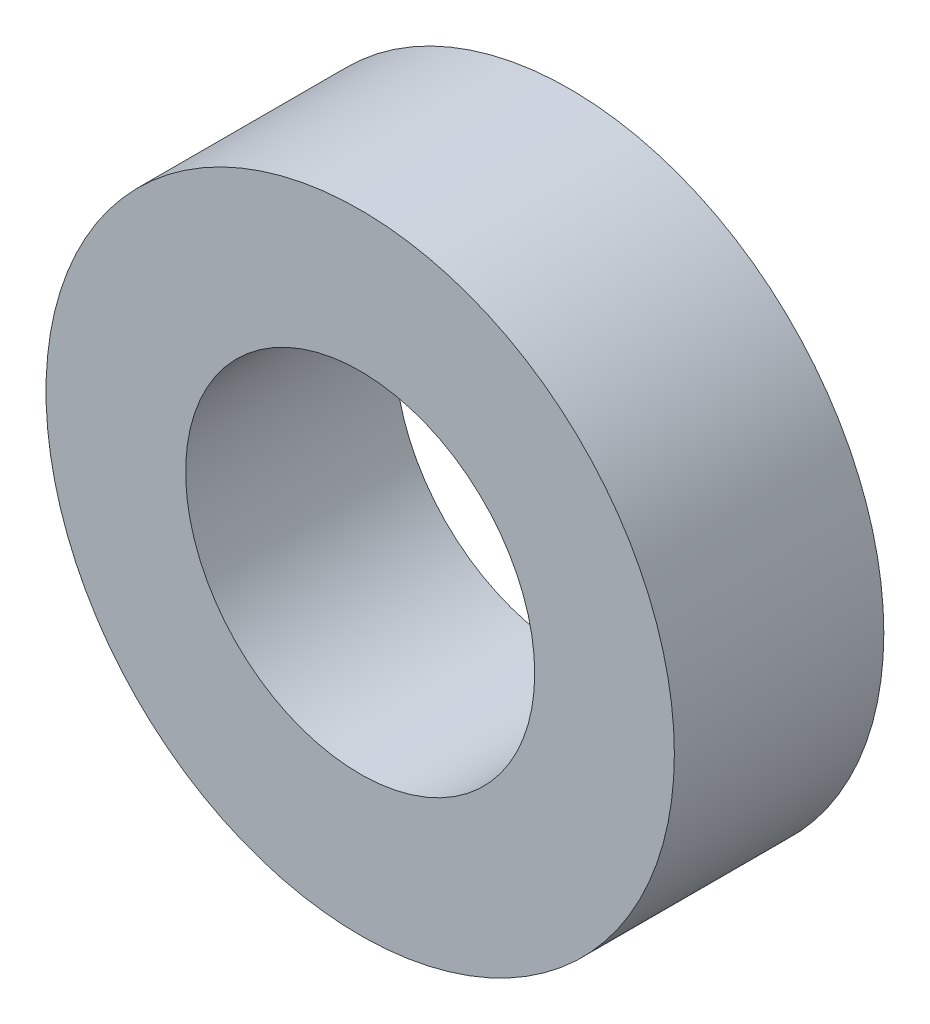
ISO-10303-21;
HEADER;
FILE_DESCRIPTION(('STEP AP214'),'2;1');
FILE_NAME('part.step','',(''),(''),'','','');
FILE_SCHEMA(('AUTOMOTIVE_DESIGN { 1 0 10303 214 1 1 1 1 }'));
ENDSEC;
DATA;
#1=APPLICATION_CONTEXT('core data for automotive mechanical design processes');
#2=APPLICATION_PROTOCOL_DEFINITION('international standard','automotive_design',2000,#1);
#3=PRODUCT_CONTEXT('',#1,'mechanical');
#4=PRODUCT('Part','Part','',(#3));
#5=PRODUCT_RELATED_PRODUCT_CATEGORY('part','',(#4));
#6=PRODUCT_DEFINITION_FORMATION('','',#4);
#7=PRODUCT_DEFINITION_CONTEXT('part definition',#1,'design');
#8=PRODUCT_DEFINITION('design','',#6,#7);
#9=PRODUCT_DEFINITION_SHAPE('','',#8);
#10=(LENGTH_UNIT() NAMED_UNIT(*) SI_UNIT(.MILLI.,.METRE.));
#11=(NAMED_UNIT(*) PLANE_ANGLE_UNIT() SI_UNIT($,.RADIAN.));
#12=(NAMED_UNIT(*) SI_UNIT($,.STERADIAN.) SOLID_ANGLE_UNIT());
#13=UNCERTAINTY_MEASURE_WITH_UNIT(LENGTH_MEASURE(1.E-05),#10,'distance_accuracy_value','');
#14=(GEOMETRIC_REPRESENTATION_CONTEXT(3) GLOBAL_UNCERTAINTY_ASSIGNED_CONTEXT((#13)) GLOBAL_UNIT_ASSIGNED_CONTEXT((#10,
#11,#12)) REPRESENTATION_CONTEXT('',''));
#15=CARTESIAN_POINT('',(0.,0.,0.));
#16=DIRECTION('',(0.,0.,1.));
#17=DIRECTION('',(1.,0.,0.));
#18=AXIS2_PLACEMENT_3D('',#15,#16,#17);
#19=CARTESIAN_POINT('',(0.,0.,3.));
#20=DIRECTION('',(0.,0.,1.));
#21=DIRECTION('',(1.,0.,0.));
#22=AXIS2_PLACEMENT_3D('',#19,#20,#21);
#23=PLANE('',#22);
#24=CARTESIAN_POINT('',(0.,0.,3.));
#25=DIRECTION('',(0.,0.,1.));
#26=DIRECTION('',(1.,0.,0.));
#27=AXIS2_PLACEMENT_3D('',#24,#25,#26);
#28=CIRCLE('',#27,4.5);
#29=CARTESIAN_POINT('',(4.5,0.,3.));
#30=VERTEX_POINT('',#29);
#31=EDGE_CURVE('E10',#30,#30,#28,.T.);
#32=ORIENTED_EDGE('',*,*,#31,.T.);
#33=EDGE_LOOP('',(#32));
#34=FACE_BOUND('',#33,.T.);
#35=CARTESIAN_POINT('',(0.,0.,3.));
#36=DIRECTION('',(0.,0.,1.));
#37=DIRECTION('',(1.,0.,0.));
#38=AXIS2_PLACEMENT_3D('',#35,#36,#37);
#39=CIRCLE('',#38,2.5);
#40=CARTESIAN_POINT('',(2.5,0.,3.));
#41=VERTEX_POINT('',#40);
#42=EDGE_CURVE('E40',#41,#41,#39,.T.);
#43=ORIENTED_EDGE('',*,*,#42,.F.);
#44=EDGE_LOOP('',(#43));
#45=FACE_BOUND('',#44,.T.);
#46=ADVANCED_FACE('F29',(#34,#45),#23,.T.);
#47=CARTESIAN_POINT('',(0.,0.,0.));
#48=DIRECTION('',(0.,0.,1.));
#49=DIRECTION('',(1.,0.,0.));
#50=AXIS2_PLACEMENT_3D('',#47,#48,#49);
#51=PLANE('',#50);
#52=CARTESIAN_POINT('',(0.,0.,0.));
#53=DIRECTION('',(0.,0.,1.));
#54=DIRECTION('',(1.,0.,0.));
#55=AXIS2_PLACEMENT_3D('',#52,#53,#54);
#56=CIRCLE('',#55,4.5);
#57=CARTESIAN_POINT('',(4.5,0.,0.));
#58=VERTEX_POINT('',#57);
#59=EDGE_CURVE('E33',#58,#58,#56,.T.);
#60=ORIENTED_EDGE('',*,*,#59,.F.);
#61=EDGE_LOOP('',(#60));
#62=FACE_BOUND('',#61,.T.);
#63=CARTESIAN_POINT('',(0.,0.,0.));
#64=DIRECTION('',(0.,0.,1.));
#65=DIRECTION('',(1.,0.,0.));
#66=AXIS2_PLACEMENT_3D('',#63,#64,#65);
#67=CIRCLE('',#66,2.5);
#68=CARTESIAN_POINT('',(2.5,0.,0.));
#69=VERTEX_POINT('',#68);
#70=EDGE_CURVE('E42',#69,#69,#67,.T.);
#71=ORIENTED_EDGE('',*,*,#70,.T.);
#72=EDGE_LOOP('',(#71));
#73=FACE_BOUND('',#72,.T.);
#74=ADVANCED_FACE('F52',(#62,#73),#51,.F.);
#75=CARTESIAN_POINT('',(0.,0.,3.));
#76=DIRECTION('',(0.,0.,-1.));
#77=DIRECTION('',(-1.,0.,0.));
#78=AXIS2_PLACEMENT_3D('',#75,#76,#77);
#79=CYLINDRICAL_SURFACE('',#78,4.5);
#80=ORIENTED_EDGE('',*,*,#31,.F.);
#81=EDGE_LOOP('',(#80));
#82=FACE_BOUND('',#81,.T.);
#83=ORIENTED_EDGE('',*,*,#59,.T.);
#84=EDGE_LOOP('',(#83));
#85=FACE_BOUND('',#84,.T.);
#86=ADVANCED_FACE('F31',(#82,#85),#79,.T.);
#87=CARTESIAN_POINT('',(0.,0.,3.));
#88=DIRECTION('',(0.,0.,-1.));
#89=DIRECTION('',(-1.,0.,0.));
#90=AXIS2_PLACEMENT_3D('',#87,#88,#89);
#91=CYLINDRICAL_SURFACE('',#90,2.5);
#92=ORIENTED_EDGE('',*,*,#42,.T.);
#93=EDGE_LOOP('',(#92));
#94=FACE_BOUND('',#93,.T.);
#95=ORIENTED_EDGE('',*,*,#70,.F.);
#96=EDGE_LOOP('',(#95));
#97=FACE_BOUND('',#96,.T.);
#98=ADVANCED_FACE('F48',(#94,#97),#91,.F.);
#99=CLOSED_SHELL('',(#46,#74,#86,#98));
#100=MANIFOLD_SOLID_BREP('B2',#99);
#101=ADVANCED_BREP_SHAPE_REPRESENTATION('',(#18,#100),#14);
#102=SHAPE_DEFINITION_REPRESENTATION(#9,#101);
ENDSEC;
END-ISO-10303-21;
